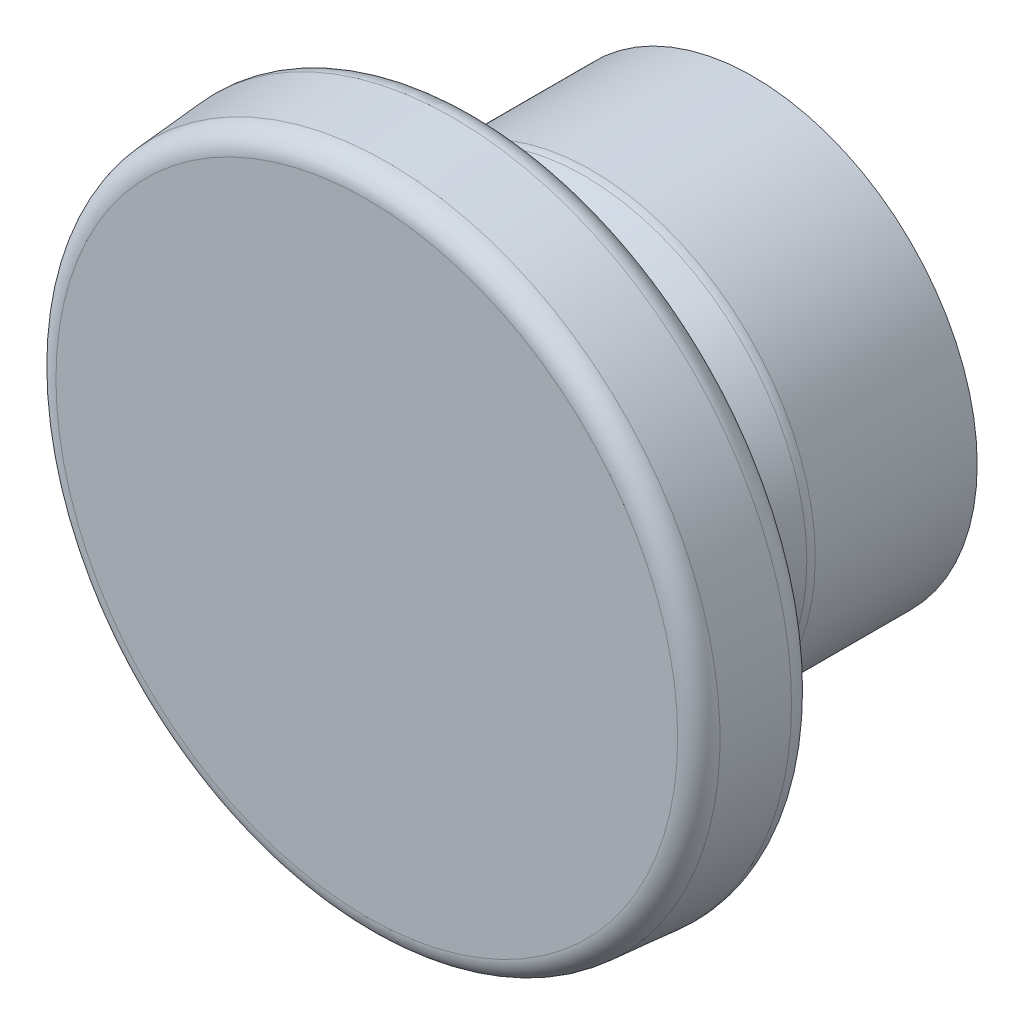
ISO-10303-21;
HEADER;
FILE_DESCRIPTION(('STEP AP214'),'2;1');
FILE_NAME('part.step','',(''),(''),'','','');
FILE_SCHEMA(('AUTOMOTIVE_DESIGN { 1 0 10303 214 1 1 1 1 }'));
ENDSEC;
DATA;
#1=APPLICATION_CONTEXT('core data for automotive mechanical design processes');
#2=APPLICATION_PROTOCOL_DEFINITION('international standard','automotive_design',2000,#1);
#3=PRODUCT_CONTEXT('',#1,'mechanical');
#4=PRODUCT('Part','Part','',(#3));
#5=PRODUCT_RELATED_PRODUCT_CATEGORY('part','',(#4));
#6=PRODUCT_DEFINITION_FORMATION('','',#4);
#7=PRODUCT_DEFINITION_CONTEXT('part definition',#1,'design');
#8=PRODUCT_DEFINITION('design','',#6,#7);
#9=PRODUCT_DEFINITION_SHAPE('','',#8);
#10=(LENGTH_UNIT() NAMED_UNIT(*) SI_UNIT(.MILLI.,.METRE.));
#11=(NAMED_UNIT(*) PLANE_ANGLE_UNIT() SI_UNIT($,.RADIAN.));
#12=(NAMED_UNIT(*) SI_UNIT($,.STERADIAN.) SOLID_ANGLE_UNIT());
#13=UNCERTAINTY_MEASURE_WITH_UNIT(LENGTH_MEASURE(1.E-05),#10,'distance_accuracy_value','');
#14=(GEOMETRIC_REPRESENTATION_CONTEXT(3) GLOBAL_UNCERTAINTY_ASSIGNED_CONTEXT((#13)) GLOBAL_UNIT_ASSIGNED_CONTEXT((#10,
#11,#12)) REPRESENTATION_CONTEXT('',''));
#15=CARTESIAN_POINT('',(0.,0.,0.));
#16=DIRECTION('',(0.,0.,1.));
#17=DIRECTION('',(1.,0.,0.));
#18=AXIS2_PLACEMENT_3D('',#15,#16,#17);
#19=CARTESIAN_POINT('',(-6.4389,0.,0.));
#20=DIRECTION('',(0.,0.,1.));
#21=DIRECTION('',(1.,0.,0.));
#22=AXIS2_PLACEMENT_3D('',#19,#20,#21);
#23=PLANE('',#22);
#24=CARTESIAN_POINT('',(0.,0.,0.));
#25=DIRECTION('',(0.,0.,1.));
#26=DIRECTION('',(1.,0.,0.));
#27=AXIS2_PLACEMENT_3D('',#24,#25,#26);
#28=CIRCLE('',#27,12.8778);
#29=CARTESIAN_POINT('',(12.8778,0.,0.));
#30=VERTEX_POINT('',#29);
#31=EDGE_CURVE('E17',#30,#30,#28,.T.);
#32=ORIENTED_EDGE('',*,*,#31,.F.);
#33=EDGE_LOOP('',(#32));
#34=FACE_BOUND('',#33,.T.);
#35=ADVANCED_FACE('F14',(#34),#23,.F.);
#36=CARTESIAN_POINT('',(0.,0.,11.1125));
#37=DIRECTION('',(0.,0.,1.));
#38=DIRECTION('',(1.,0.,0.));
#39=AXIS2_PLACEMENT_3D('',#36,#37,#38);
#40=CYLINDRICAL_SURFACE('',#39,12.8778);
#41=ORIENTED_EDGE('',*,*,#31,.T.);
#42=EDGE_LOOP('',(#41));
#43=FACE_BOUND('',#42,.T.);
#44=CARTESIAN_POINT('',(0.,0.,9.31062488196954));
#45=DIRECTION('',(0.,0.,1.));
#46=DIRECTION('',(1.,0.,0.));
#47=AXIS2_PLACEMENT_3D('',#44,#45,#46);
#48=CIRCLE('',#47,12.8778);
#49=CARTESIAN_POINT('',(12.8778,0.,9.31062488196954));
#50=VERTEX_POINT('',#49);
#51=EDGE_CURVE('E101',#50,#50,#48,.T.);
#52=ORIENTED_EDGE('',*,*,#51,.F.);
#53=EDGE_LOOP('',(#52));
#54=FACE_BOUND('',#53,.T.);
#55=ADVANCED_FACE('F112',(#43,#54),#40,.T.);
#56=CARTESIAN_POINT('',(0.,0.,9.31062488196954));
#57=DIRECTION('',(0.,0.,1.));
#58=DIRECTION('',(1.,0.,0.));
#59=AXIS2_PLACEMENT_3D('',#56,#57,#58);
#60=TOROIDAL_SURFACE('',#59,11.6078,1.27);
#61=ORIENTED_EDGE('',*,*,#51,.T.);
#62=EDGE_LOOP('',(#61));
#63=FACE_BOUND('',#62,.T.);
#64=CARTESIAN_POINT('',(0.,0.,9.72749709240072));
#65=DIRECTION('',(0.,0.,-1.));
#66=DIRECTION('',(-1.,0.,0.));
#67=AXIS2_PLACEMENT_3D('',#64,#65,#66);
#68=CIRCLE('',#67,12.8074322602336);
#69=CARTESIAN_POINT('',(-12.8074322602336,0.,9.72749709240072));
#70=VERTEX_POINT('',#69);
#71=EDGE_CURVE('E96',#70,#70,#68,.F.);
#72=ORIENTED_EDGE('',*,*,#71,.F.);
#73=EDGE_LOOP('',(#72));
#74=FACE_BOUND('',#73,.T.);
#75=ADVANCED_FACE('F108',(#63,#74),#60,.T.);
#76=CARTESIAN_POINT('',(0.,0.,9.72749709240072));
#77=DIRECTION('',(0.,0.,-1.));
#78=DIRECTION('',(-1.,0.,0.));
#79=AXIS2_PLACEMENT_3D('',#76,#77,#78);
#80=CONICAL_SURFACE('',#79,12.8074322602336,0.3344459141);
#81=CARTESIAN_POINT('',(0.,0.,14.605));
#82=DIRECTION('',(0.,0.,1.));
#83=DIRECTION('',(1.,0.,0.));
#84=AXIS2_PLACEMENT_3D('',#81,#82,#83);
#85=CIRCLE('',#84,11.1125);
#86=CARTESIAN_POINT('',(11.1125,0.,14.605));
#87=VERTEX_POINT('',#86);
#88=EDGE_CURVE('E87',#87,#87,#85,.T.);
#89=ORIENTED_EDGE('',*,*,#88,.F.);
#90=EDGE_LOOP('',(#89));
#91=FACE_BOUND('',#90,.T.);
#92=ORIENTED_EDGE('',*,*,#71,.T.);
#93=EDGE_LOOP('',(#92));
#94=FACE_BOUND('',#93,.T.);
#95=ADVANCED_FACE('F111',(#91,#94),#80,.T.);
#96=CARTESIAN_POINT('',(0.,0.,11.1125));
#97=DIRECTION('',(0.,0.,1.));
#98=DIRECTION('',(1.,0.,0.));
#99=AXIS2_PLACEMENT_3D('',#96,#97,#98);
#100=CYLINDRICAL_SURFACE('',#99,11.1125);
#101=CARTESIAN_POINT('',(0.,0.,15.875));
#102=DIRECTION('',(0.,0.,1.));
#103=DIRECTION('',(1.,0.,0.));
#104=AXIS2_PLACEMENT_3D('',#101,#102,#103);
#105=CIRCLE('',#104,11.1125);
#106=CARTESIAN_POINT('',(11.1125,0.,15.875));
#107=VERTEX_POINT('',#106);
#108=EDGE_CURVE('E95',#107,#107,#105,.F.);
#109=ORIENTED_EDGE('',*,*,#108,.T.);
#110=EDGE_LOOP('',(#109));
#111=FACE_BOUND('',#110,.T.);
#112=ORIENTED_EDGE('',*,*,#88,.T.);
#113=EDGE_LOOP('',(#112));
#114=FACE_BOUND('',#113,.T.);
#115=ADVANCED_FACE('F155',(#111,#114),#100,.T.);
#116=CARTESIAN_POINT('',(-15.33525,0.,15.875));
#117=DIRECTION('',(0.,0.,1.));
#118=DIRECTION('',(1.,0.,0.));
#119=AXIS2_PLACEMENT_3D('',#116,#117,#118);
#120=PLANE('',#119);
#121=ORIENTED_EDGE('',*,*,#108,.F.);
#122=EDGE_LOOP('',(#121));
#123=FACE_BOUND('',#122,.T.);
#124=CARTESIAN_POINT('',(0.,0.,15.875));
#125=DIRECTION('',(0.,0.,1.));
#126=DIRECTION('',(1.,0.,0.));
#127=AXIS2_PLACEMENT_3D('',#124,#125,#126);
#128=CIRCLE('',#127,18.1823424816752);
#129=CARTESIAN_POINT('',(18.1823424816752,0.,15.875));
#130=VERTEX_POINT('',#129);
#131=EDGE_CURVE('E31',#130,#130,#128,.T.);
#132=ORIENTED_EDGE('',*,*,#131,.F.);
#133=EDGE_LOOP('',(#132));
#134=FACE_BOUND('',#133,.T.);
#135=ADVANCED_FACE('F64',(#123,#134),#120,.F.);
#136=CARTESIAN_POINT('',(0.,0.,17.145));
#137=DIRECTION('',(0.,0.,1.));
#138=DIRECTION('',(1.,0.,0.));
#139=AXIS2_PLACEMENT_3D('',#136,#137,#138);
#140=TOROIDAL_SURFACE('',#139,18.1823425,1.27);
#141=ORIENTED_EDGE('',*,*,#131,.T.);
#142=EDGE_LOOP('',(#141));
#143=FACE_BOUND('',#142,.T.);
#144=CARTESIAN_POINT('',(0.,0.,17.2462764322943));
#145=DIRECTION('',(0.,0.,-1.));
#146=DIRECTION('',(-1.,0.,0.));
#147=AXIS2_PLACEMENT_3D('',#144,#145,#146);
#148=CIRCLE('',#147,19.4482978853551);
#149=CARTESIAN_POINT('',(-19.4482978853551,0.,17.2462764322943));
#150=VERTEX_POINT('',#149);
#151=EDGE_CURVE('E26',#150,#150,#148,.F.);
#152=ORIENTED_EDGE('',*,*,#151,.F.);
#153=EDGE_LOOP('',(#152));
#154=FACE_BOUND('',#153,.T.);
#155=ADVANCED_FACE('F58',(#143,#154),#140,.T.);
#156=CARTESIAN_POINT('',(0.,0.,17.2462764322944));
#157=DIRECTION('',(0.,0.,-1.));
#158=DIRECTION('',(-1.,0.,0.));
#159=AXIS2_PLACEMENT_3D('',#156,#157,#158);
#160=CONICAL_SURFACE('',#159,19.4482978853551,0.0798299857000003);
#161=ORIENTED_EDGE('',*,*,#151,.T.);
#162=EDGE_LOOP('',(#161));
#163=FACE_BOUND('',#162,.T.);
#164=CARTESIAN_POINT('',(0.,0.,21.056276433756));
#165=DIRECTION('',(0.,0.,-1.));
#166=DIRECTION('',(-1.,0.,0.));
#167=AXIS2_PLACEMENT_3D('',#164,#165,#166);
#168=CIRCLE('',#167,19.1434979036243);
#169=CARTESIAN_POINT('',(-19.1434979036243,0.,21.056276433756));
#170=VERTEX_POINT('',#169);
#171=EDGE_CURVE('E21',#170,#170,#168,.F.);
#172=ORIENTED_EDGE('',*,*,#171,.F.);
#173=EDGE_LOOP('',(#172));
#174=FACE_BOUND('',#173,.T.);
#175=ADVANCED_FACE('F54',(#163,#174),#160,.T.);
#176=CARTESIAN_POINT('',(0.,0.,20.955));
#177=DIRECTION('',(0.,0.,-1.));
#178=DIRECTION('',(-1.,0.,0.));
#179=AXIS2_PLACEMENT_3D('',#176,#177,#178);
#180=TOROIDAL_SURFACE('',#179,17.8775425,1.27);
#181=ORIENTED_EDGE('',*,*,#171,.T.);
#182=EDGE_LOOP('',(#181));
#183=FACE_BOUND('',#182,.T.);
#184=CARTESIAN_POINT('',(0.,0.,22.225));
#185=DIRECTION('',(0.,0.,-1.));
#186=DIRECTION('',(-1.,0.,0.));
#187=AXIS2_PLACEMENT_3D('',#184,#185,#186);
#188=CIRCLE('',#187,17.8775424816752);
#189=CARTESIAN_POINT('',(-17.8775424816752,0.,22.225));
#190=VERTEX_POINT('',#189);
#191=EDGE_CURVE('E10',#190,#190,#188,.T.);
#192=ORIENTED_EDGE('',*,*,#191,.T.);
#193=EDGE_LOOP('',(#192));
#194=FACE_BOUND('',#193,.T.);
#195=ADVANCED_FACE('F43',(#183,#194),#180,.T.);
#196=CARTESIAN_POINT('',(-9.525,0.,22.225));
#197=DIRECTION('',(0.,0.,-1.));
#198=DIRECTION('',(-1.,0.,0.));
#199=AXIS2_PLACEMENT_3D('',#196,#197,#198);
#200=PLANE('',#199);
#201=ORIENTED_EDGE('',*,*,#191,.F.);
#202=EDGE_LOOP('',(#201));
#203=FACE_BOUND('',#202,.T.);
#204=ADVANCED_FACE('F53',(#203),#200,.F.);
#205=CLOSED_SHELL('',(#35,#55,#75,#95,#115,#135,#155,#175,#195,#204));
#206=MANIFOLD_SOLID_BREP('B1',#205);
#207=ADVANCED_BREP_SHAPE_REPRESENTATION('',(#18,#206),#14);
#208=SHAPE_DEFINITION_REPRESENTATION(#9,#207);
ENDSEC;
END-ISO-10303-21;
